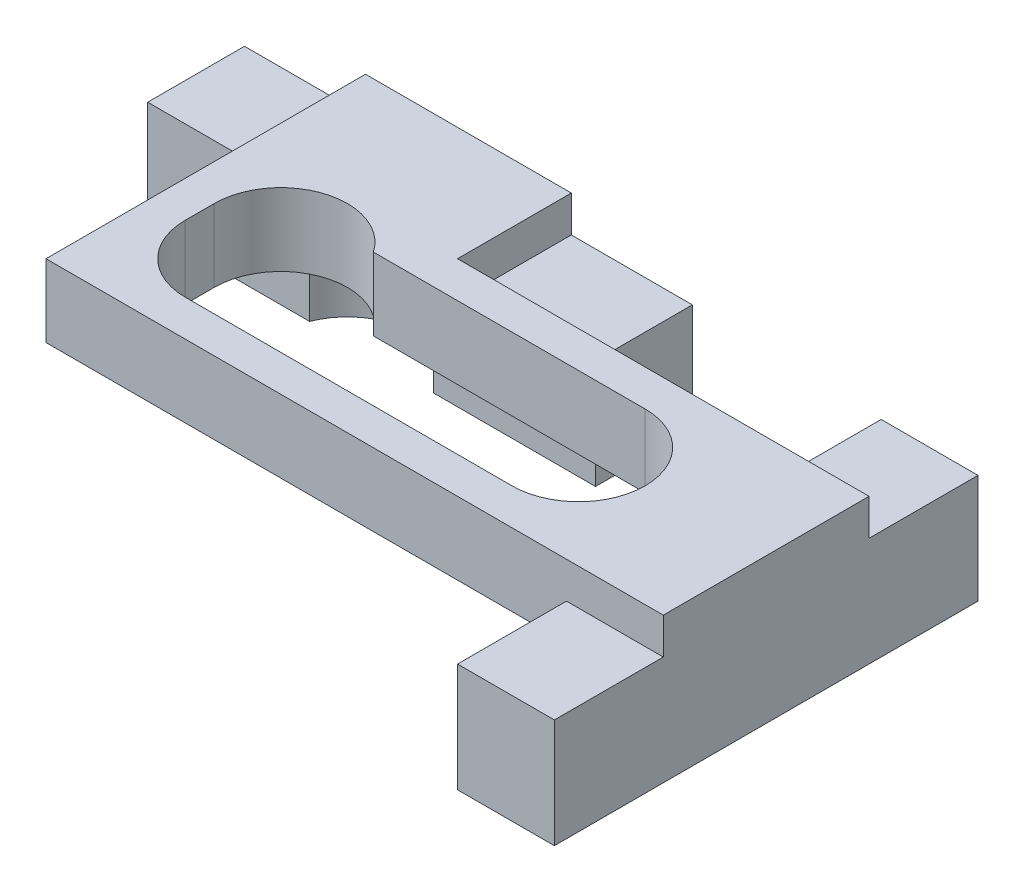
ISO-10303-21;
HEADER;
FILE_DESCRIPTION(('STEP AP214'),'2;1');
FILE_NAME('part.step','',(''),(''),'','','');
FILE_SCHEMA(('AUTOMOTIVE_DESIGN { 1 0 10303 214 1 1 1 1 }'));
ENDSEC;
DATA;
#1=APPLICATION_CONTEXT('core data for automotive mechanical design processes');
#2=APPLICATION_PROTOCOL_DEFINITION('international standard','automotive_design',2000,#1);
#3=PRODUCT_CONTEXT('',#1,'mechanical');
#4=PRODUCT('Part','Part','',(#3));
#5=PRODUCT_RELATED_PRODUCT_CATEGORY('part','',(#4));
#6=PRODUCT_DEFINITION_FORMATION('','',#4);
#7=PRODUCT_DEFINITION_CONTEXT('part definition',#1,'design');
#8=PRODUCT_DEFINITION('design','',#6,#7);
#9=PRODUCT_DEFINITION_SHAPE('','',#8);
#10=(LENGTH_UNIT() NAMED_UNIT(*) SI_UNIT(.MILLI.,.METRE.));
#11=(NAMED_UNIT(*) PLANE_ANGLE_UNIT() SI_UNIT($,.RADIAN.));
#12=(NAMED_UNIT(*) SI_UNIT($,.STERADIAN.) SOLID_ANGLE_UNIT());
#13=UNCERTAINTY_MEASURE_WITH_UNIT(LENGTH_MEASURE(1.E-05),#10,'distance_accuracy_value','');
#14=(GEOMETRIC_REPRESENTATION_CONTEXT(3) GLOBAL_UNCERTAINTY_ASSIGNED_CONTEXT((#13)) GLOBAL_UNIT_ASSIGNED_CONTEXT((#10,
#11,#12)) REPRESENTATION_CONTEXT('',''));
#15=CARTESIAN_POINT('',(0.,0.,0.));
#16=DIRECTION('',(0.,0.,1.));
#17=DIRECTION('',(1.,0.,0.));
#18=AXIS2_PLACEMENT_3D('',#15,#16,#17);
#19=CARTESIAN_POINT('',(0.,0.,4.));
#20=DIRECTION('',(0.,0.,-1.));
#21=DIRECTION('',(-1.,0.,0.));
#22=AXIS2_PLACEMENT_3D('',#19,#20,#21);
#23=PLANE('',#22);
#24=DIRECTION('',(1.,0.,0.));
#25=VECTOR('',#24,1.);
#26=CARTESIAN_POINT('',(-4.25,3.,4.));
#27=LINE('',#26,#25);
#28=CARTESIAN_POINT('',(2.5617376914899,3.,4.));
#29=VERTEX_POINT('',#28);
#30=CARTESIAN_POINT('',(4.25,3.,4.));
#31=VERTEX_POINT('',#30);
#32=EDGE_CURVE('E252',#29,#31,#27,.T.);
#33=ORIENTED_EDGE('',*,*,#32,.F.);
#34=DIRECTION('',(0.,-1.,0.));
#35=VECTOR('',#34,1.);
#36=CARTESIAN_POINT('',(2.5617376914899,3.,4.));
#37=LINE('',#36,#35);
#38=CARTESIAN_POINT('',(2.5617376914899,0.,4.));
#39=VERTEX_POINT('',#38);
#40=EDGE_CURVE('E479',#29,#39,#37,.T.);
#41=ORIENTED_EDGE('',*,*,#40,.T.);
#42=DIRECTION('',(1.,0.,0.));
#43=VECTOR('',#42,1.);
#44=CARTESIAN_POINT('',(9.25,0.,4.));
#45=LINE('',#44,#43);
#46=CARTESIAN_POINT('',(9.25,0.,4.));
#47=VERTEX_POINT('',#46);
#48=EDGE_CURVE('E272',#39,#47,#45,.T.);
#49=ORIENTED_EDGE('',*,*,#48,.T.);
#50=DIRECTION('',(0.,1.,0.));
#51=VECTOR('',#50,1.);
#52=CARTESIAN_POINT('',(9.25,0.,4.));
#53=LINE('',#52,#51);
#54=CARTESIAN_POINT('',(9.25,4.5,4.));
#55=VERTEX_POINT('',#54);
#56=EDGE_CURVE('E277',#47,#55,#53,.T.);
#57=ORIENTED_EDGE('',*,*,#56,.T.);
#58=DIRECTION('',(1.,0.,0.));
#59=VECTOR('',#58,1.);
#60=CARTESIAN_POINT('',(4.25,4.5,4.));
#61=LINE('',#60,#59);
#62=CARTESIAN_POINT('',(4.25,4.5,4.));
#63=VERTEX_POINT('',#62);
#64=EDGE_CURVE('E484',#63,#55,#61,.T.);
#65=ORIENTED_EDGE('',*,*,#64,.F.);
#66=DIRECTION('',(0.,-1.,0.));
#67=VECTOR('',#66,1.);
#68=CARTESIAN_POINT('',(4.25,4.5,4.));
#69=LINE('',#68,#67);
#70=EDGE_CURVE('E493',#63,#31,#69,.T.);
#71=ORIENTED_EDGE('',*,*,#70,.T.);
#72=EDGE_LOOP('',(#33,#41,#49,#57,#65,#71));
#73=FACE_BOUND('',#72,.T.);
#74=ADVANCED_FACE('F32',(#73),#23,.F.);
#75=CARTESIAN_POINT('',(17.25,0.,0.));
#76=DIRECTION('',(1.,0.,0.));
#77=DIRECTION('',(0.,0.,-1.));
#78=AXIS2_PLACEMENT_3D('',#75,#76,#77);
#79=PLANE('',#78);
#80=DIRECTION('',(0.,0.,-1.));
#81=VECTOR('',#80,1.);
#82=CARTESIAN_POINT('',(17.25,3.,13.2));
#83=LINE('',#82,#81);
#84=CARTESIAN_POINT('',(17.25,3.,13.2));
#85=VERTEX_POINT('',#84);
#86=CARTESIAN_POINT('',(17.25,3.,11.5117376914899));
#87=VERTEX_POINT('',#86);
#88=EDGE_CURVE('E229',#85,#87,#83,.T.);
#89=ORIENTED_EDGE('',*,*,#88,.T.);
#90=DIRECTION('',(0.,-1.,0.));
#91=VECTOR('',#90,1.);
#92=CARTESIAN_POINT('',(17.25,3.,11.5117376914899));
#93=LINE('',#92,#91);
#94=CARTESIAN_POINT('',(17.25,0.,11.5117376914899));
#95=VERTEX_POINT('',#94);
#96=EDGE_CURVE('E214',#87,#95,#93,.T.);
#97=ORIENTED_EDGE('',*,*,#96,.T.);
#98=DIRECTION('',(0.,0.,-1.));
#99=VECTOR('',#98,1.);
#100=CARTESIAN_POINT('',(17.25,0.,17.7));
#101=LINE('',#100,#99);
#102=CARTESIAN_POINT('',(17.25,0.,17.7));
#103=VERTEX_POINT('',#102);
#104=EDGE_CURVE('E349',#103,#95,#101,.T.);
#105=ORIENTED_EDGE('',*,*,#104,.F.);
#106=DIRECTION('',(0.,-1.,0.));
#107=VECTOR('',#106,1.);
#108=CARTESIAN_POINT('',(17.25,0.,17.7));
#109=LINE('',#108,#107);
#110=CARTESIAN_POINT('',(17.25,4.5,17.7));
#111=VERTEX_POINT('',#110);
#112=EDGE_CURVE('E370',#111,#103,#109,.T.);
#113=ORIENTED_EDGE('',*,*,#112,.F.);
#114=DIRECTION('',(0.,0.,1.));
#115=VECTOR('',#114,1.);
#116=CARTESIAN_POINT('',(17.25,4.5,17.7));
#117=LINE('',#116,#115);
#118=CARTESIAN_POINT('',(17.25,4.5,13.2));
#119=VERTEX_POINT('',#118);
#120=EDGE_CURVE('E368',#119,#111,#117,.T.);
#121=ORIENTED_EDGE('',*,*,#120,.F.);
#122=DIRECTION('',(0.,-1.,0.));
#123=VECTOR('',#122,1.);
#124=CARTESIAN_POINT('',(17.25,6.,13.2));
#125=LINE('',#124,#123);
#126=EDGE_CURVE('E237',#119,#85,#125,.T.);
#127=ORIENTED_EDGE('',*,*,#126,.T.);
#128=EDGE_LOOP('',(#89,#97,#105,#113,#121,#127));
#129=FACE_BOUND('',#128,.T.);
#130=ADVANCED_FACE('F235',(#129),#79,.F.);
#131=CARTESIAN_POINT('',(4.25,3.,4.));
#132=DIRECTION('',(-1.,0.,0.));
#133=DIRECTION('',(0.,0.,1.));
#134=AXIS2_PLACEMENT_3D('',#131,#132,#133);
#135=PLANE('',#134);
#136=ORIENTED_EDGE('',*,*,#70,.F.);
#137=DIRECTION('',(0.,0.,1.));
#138=VECTOR('',#137,1.);
#139=CARTESIAN_POINT('',(4.25,4.5,0.));
#140=LINE('',#139,#138);
#141=CARTESIAN_POINT('',(4.25,4.5,0.));
#142=VERTEX_POINT('',#141);
#143=EDGE_CURVE('E481',#142,#63,#140,.T.);
#144=ORIENTED_EDGE('',*,*,#143,.F.);
#145=DIRECTION('',(0.,1.,0.));
#146=VECTOR('',#145,1.);
#147=CARTESIAN_POINT('',(4.25,3.,0.));
#148=LINE('',#147,#146);
#149=CARTESIAN_POINT('',(4.25,6.,0.));
#150=VERTEX_POINT('',#149);
#151=EDGE_CURVE('E269',#142,#150,#148,.T.);
#152=ORIENTED_EDGE('',*,*,#151,.T.);
#153=DIRECTION('',(0.,0.,-1.));
#154=VECTOR('',#153,1.);
#155=CARTESIAN_POINT('',(4.25,6.,4.));
#156=LINE('',#155,#154);
#157=CARTESIAN_POINT('',(4.25,6.,4.7));
#158=VERTEX_POINT('',#157);
#159=EDGE_CURVE('E298',#158,#150,#156,.T.);
#160=ORIENTED_EDGE('',*,*,#159,.F.);
#161=DIRECTION('',(0.,1.,0.));
#162=VECTOR('',#161,1.);
#163=CARTESIAN_POINT('',(4.25,6.,4.7));
#164=LINE('',#163,#162);
#165=CARTESIAN_POINT('',(4.25,3.,4.7));
#166=VERTEX_POINT('',#165);
#167=EDGE_CURVE('E245',#166,#158,#164,.T.);
#168=ORIENTED_EDGE('',*,*,#167,.F.);
#169=DIRECTION('',(0.,0.,-1.));
#170=VECTOR('',#169,1.);
#171=CARTESIAN_POINT('',(4.25,3.,13.2));
#172=LINE('',#171,#170);
#173=EDGE_CURVE('E262',#166,#31,#172,.T.);
#174=ORIENTED_EDGE('',*,*,#173,.T.);
#175=EDGE_LOOP('',(#136,#144,#152,#160,#168,#174));
#176=FACE_BOUND('',#175,.T.);
#177=ADVANCED_FACE('F34',(#176),#135,.F.);
#178=CARTESIAN_POINT('',(-4.25,3.,4.));
#179=DIRECTION('',(1.,0.,0.));
#180=DIRECTION('',(0.,0.,-1.));
#181=AXIS2_PLACEMENT_3D('',#178,#179,#180);
#182=PLANE('',#181);
#183=DIRECTION('',(0.,-1.,0.));
#184=VECTOR('',#183,1.);
#185=CARTESIAN_POINT('',(-4.25,4.49999999999999,4.));
#186=LINE('',#185,#184);
#187=CARTESIAN_POINT('',(-4.25,4.49999999999999,4.));
#188=VERTEX_POINT('',#187);
#189=CARTESIAN_POINT('',(-4.25,3.,4.));
#190=VERTEX_POINT('',#189);
#191=EDGE_CURVE('E421',#188,#190,#186,.T.);
#192=ORIENTED_EDGE('',*,*,#191,.T.);
#193=DIRECTION('',(0.,0.,-1.));
#194=VECTOR('',#193,1.);
#195=CARTESIAN_POINT('',(-4.25,3.,13.2));
#196=LINE('',#195,#194);
#197=CARTESIAN_POINT('',(-4.25,3.,13.2));
#198=VERTEX_POINT('',#197);
#199=EDGE_CURVE('E266',#198,#190,#196,.T.);
#200=ORIENTED_EDGE('',*,*,#199,.F.);
#201=DIRECTION('',(0.,-1.,0.));
#202=VECTOR('',#201,1.);
#203=CARTESIAN_POINT('',(-4.25,6.,13.2));
#204=LINE('',#203,#202);
#205=CARTESIAN_POINT('',(-4.25,6.,13.2));
#206=VERTEX_POINT('',#205);
#207=EDGE_CURVE('E253',#206,#198,#204,.T.);
#208=ORIENTED_EDGE('',*,*,#207,.F.);
#209=DIRECTION('',(0.,0.,-1.));
#210=VECTOR('',#209,1.);
#211=CARTESIAN_POINT('',(-4.25,6.,4.));
#212=LINE('',#211,#210);
#213=CARTESIAN_POINT('',(-4.25,6.,0.));
#214=VERTEX_POINT('',#213);
#215=EDGE_CURVE('E295',#206,#214,#212,.T.);
#216=ORIENTED_EDGE('',*,*,#215,.T.);
#217=DIRECTION('',(0.,-1.,0.));
#218=VECTOR('',#217,1.);
#219=CARTESIAN_POINT('',(-4.25,3.,0.));
#220=LINE('',#219,#218);
#221=CARTESIAN_POINT('',(-4.25,4.49999999999999,0.));
#222=VERTEX_POINT('',#221);
#223=EDGE_CURVE('E283',#214,#222,#220,.T.);
#224=ORIENTED_EDGE('',*,*,#223,.T.);
#225=DIRECTION('',(0.,0.,-1.));
#226=VECTOR('',#225,1.);
#227=CARTESIAN_POINT('',(-4.25,4.49999999999999,0.));
#228=LINE('',#227,#226);
#229=EDGE_CURVE('E502',#188,#222,#228,.T.);
#230=ORIENTED_EDGE('',*,*,#229,.F.);
#231=EDGE_LOOP('',(#192,#200,#208,#216,#224,#230));
#232=FACE_BOUND('',#231,.T.);
#233=ADVANCED_FACE('F418',(#232),#182,.F.);
#234=CARTESIAN_POINT('',(-9.25,0.,4.));
#235=VERTEX_POINT('',#234);
#236=CARTESIAN_POINT('',(-2.5617376914899,0.,4.));
#237=VERTEX_POINT('',#236);
#238=EDGE_CURVE('E274',#235,#237,#45,.T.);
#239=ORIENTED_EDGE('',*,*,#238,.T.);
#240=DIRECTION('',(0.,-1.,0.));
#241=VECTOR('',#240,1.);
#242=CARTESIAN_POINT('',(-2.5617376914899,3.,4.));
#243=LINE('',#242,#241);
#244=CARTESIAN_POINT('',(-2.5617376914899,3.,4.));
#245=VERTEX_POINT('',#244);
#246=EDGE_CURVE('E47',#237,#245,#243,.F.);
#247=ORIENTED_EDGE('',*,*,#246,.T.);
#248=EDGE_CURVE('E257',#190,#245,#27,.T.);
#249=ORIENTED_EDGE('',*,*,#248,.F.);
#250=ORIENTED_EDGE('',*,*,#191,.F.);
#251=DIRECTION('',(1.,0.,0.));
#252=VECTOR('',#251,1.);
#253=CARTESIAN_POINT('',(-9.25,4.49999999999999,4.));
#254=LINE('',#253,#252);
#255=CARTESIAN_POINT('',(-9.25,4.49999999999999,4.));
#256=VERTEX_POINT('',#255);
#257=EDGE_CURVE('E499',#256,#188,#254,.T.);
#258=ORIENTED_EDGE('',*,*,#257,.F.);
#259=DIRECTION('',(0.,-1.,0.));
#260=VECTOR('',#259,1.);
#261=CARTESIAN_POINT('',(-9.25,0.,4.));
#262=LINE('',#261,#260);
#263=EDGE_CURVE('E270',#256,#235,#262,.T.);
#264=ORIENTED_EDGE('',*,*,#263,.T.);
#265=EDGE_LOOP('',(#239,#247,#249,#250,#258,#264));
#266=FACE_BOUND('',#265,.T.);
#267=ADVANCED_FACE('F448',(#266),#23,.F.);
#268=CARTESIAN_POINT('',(-4.25,6.,4.));
#269=DIRECTION('',(0.,-1.,0.));
#270=DIRECTION('',(0.,0.,-1.));
#271=AXIS2_PLACEMENT_3D('',#268,#269,#270);
#272=PLANE('',#271);
#273=DIRECTION('',(1.,0.,0.));
#274=VECTOR('',#273,1.);
#275=CARTESIAN_POINT('',(13.5,6.,11.7));
#276=LINE('',#275,#274);
#277=CARTESIAN_POINT('',(0.,6.,11.7));
#278=VERTEX_POINT('',#277);
#279=CARTESIAN_POINT('',(13.5,6.,11.7));
#280=VERTEX_POINT('',#279);
#281=EDGE_CURVE('E511',#278,#280,#276,.T.);
#282=ORIENTED_EDGE('',*,*,#281,.F.);
#283=CARTESIAN_POINT('',(0.,6.,8.95));
#284=DIRECTION('',(0.,1.,0.));
#285=DIRECTION('',(0.,0.,-1.));
#286=AXIS2_PLACEMENT_3D('',#283,#284,#285);
#287=CIRCLE('',#286,2.75);
#288=CARTESIAN_POINT('',(-2.75,6.,8.95));
#289=VERTEX_POINT('',#288);
#290=EDGE_CURVE('E509',#289,#278,#287,.T.);
#291=ORIENTED_EDGE('',*,*,#290,.F.);
#292=DIRECTION('',(0.,0.,1.));
#293=VECTOR('',#292,1.);
#294=CARTESIAN_POINT('',(-2.75,6.,7.75));
#295=LINE('',#294,#293);
#296=CARTESIAN_POINT('',(-2.75,6.,7.75));
#297=VERTEX_POINT('',#296);
#298=EDGE_CURVE('E326',#297,#289,#295,.T.);
#299=ORIENTED_EDGE('',*,*,#298,.F.);
#300=CARTESIAN_POINT('',(0.,6.,7.75));
#301=DIRECTION('',(0.,1.,0.));
#302=DIRECTION('',(0.,0.,1.));
#303=AXIS2_PLACEMENT_3D('',#300,#301,#302);
#304=CIRCLE('',#303,2.75);
#305=CARTESIAN_POINT('',(2.27156333832011,6.,6.2));
#306=VERTEX_POINT('',#305);
#307=EDGE_CURVE('E519',#306,#297,#304,.T.);
#308=ORIENTED_EDGE('',*,*,#307,.F.);
#309=DIRECTION('',(-1.,0.,0.));
#310=VECTOR('',#309,1.);
#311=CARTESIAN_POINT('',(13.5,6.,6.2));
#312=LINE('',#311,#310);
#313=CARTESIAN_POINT('',(13.5,6.,6.2));
#314=VERTEX_POINT('',#313);
#315=EDGE_CURVE('E517',#314,#306,#312,.T.);
#316=ORIENTED_EDGE('',*,*,#315,.F.);
#317=CARTESIAN_POINT('',(13.5,6.,8.95));
#318=DIRECTION('',(0.,1.,0.));
#319=DIRECTION('',(0.,0.,1.));
#320=AXIS2_PLACEMENT_3D('',#317,#318,#319);
#321=CIRCLE('',#320,2.75);
#322=EDGE_CURVE('E514',#280,#314,#321,.T.);
#323=ORIENTED_EDGE('',*,*,#322,.F.);
#324=EDGE_LOOP('',(#282,#291,#299,#308,#316,#323));
#325=FACE_BOUND('',#324,.T.);
#326=DIRECTION('',(-1.,0.,0.));
#327=VECTOR('',#326,1.);
#328=CARTESIAN_POINT('',(-4.25,6.,0.));
#329=LINE('',#328,#327);
#330=EDGE_CURVE('E281',#150,#214,#329,.T.);
#331=ORIENTED_EDGE('',*,*,#330,.T.);
#332=ORIENTED_EDGE('',*,*,#215,.F.);
#333=DIRECTION('',(-1.,0.,0.));
#334=VECTOR('',#333,1.);
#335=CARTESIAN_POINT('',(-4.25,6.,13.2));
#336=LINE('',#335,#334);
#337=CARTESIAN_POINT('',(21.25,6.,13.2));
#338=VERTEX_POINT('',#337);
#339=EDGE_CURVE('E259',#338,#206,#336,.T.);
#340=ORIENTED_EDGE('',*,*,#339,.F.);
#341=DIRECTION('',(0.,0.,1.));
#342=VECTOR('',#341,1.);
#343=CARTESIAN_POINT('',(21.25,6.,13.2));
#344=LINE('',#343,#342);
#345=CARTESIAN_POINT('',(21.25,6.,4.7));
#346=VERTEX_POINT('',#345);
#347=EDGE_CURVE('E354',#346,#338,#344,.T.);
#348=ORIENTED_EDGE('',*,*,#347,.F.);
#349=DIRECTION('',(-1.,0.,0.));
#350=VECTOR('',#349,1.);
#351=CARTESIAN_POINT('',(17.25,6.,4.7));
#352=LINE('',#351,#350);
#353=EDGE_CURVE('E240',#346,#158,#352,.T.);
#354=ORIENTED_EDGE('',*,*,#353,.T.);
#355=ORIENTED_EDGE('',*,*,#159,.T.);
#356=EDGE_LOOP('',(#331,#332,#340,#348,#354,#355));
#357=FACE_BOUND('',#356,.T.);
#358=ADVANCED_FACE('F410',(#325,#357),#272,.F.);
#359=CARTESIAN_POINT('',(-9.25,0.,4.));
#360=DIRECTION('',(1.,0.,0.));
#361=DIRECTION('',(0.,0.,-1.));
#362=AXIS2_PLACEMENT_3D('',#359,#360,#361);
#363=PLANE('',#362);
#364=DIRECTION('',(0.,-1.,0.));
#365=VECTOR('',#364,1.);
#366=CARTESIAN_POINT('',(-9.25,0.,0.));
#367=LINE('',#366,#365);
#368=CARTESIAN_POINT('',(-9.25,4.49999999999999,0.));
#369=VERTEX_POINT('',#368);
#370=CARTESIAN_POINT('',(-9.25,0.,0.));
#371=VERTEX_POINT('',#370);
#372=EDGE_CURVE('E285',#369,#371,#367,.T.);
#373=ORIENTED_EDGE('',*,*,#372,.T.);
#374=DIRECTION('',(0.,0.,-1.));
#375=VECTOR('',#374,1.);
#376=CARTESIAN_POINT('',(-9.25,0.,4.));
#377=LINE('',#376,#375);
#378=EDGE_CURVE('E292',#235,#371,#377,.T.);
#379=ORIENTED_EDGE('',*,*,#378,.F.);
#380=ORIENTED_EDGE('',*,*,#263,.F.);
#381=DIRECTION('',(0.,0.,1.));
#382=VECTOR('',#381,1.);
#383=CARTESIAN_POINT('',(-9.25,4.49999999999999,0.));
#384=LINE('',#383,#382);
#385=EDGE_CURVE('E496',#369,#256,#384,.T.);
#386=ORIENTED_EDGE('',*,*,#385,.F.);
#387=EDGE_LOOP('',(#373,#379,#380,#386));
#388=FACE_BOUND('',#387,.T.);
#389=ADVANCED_FACE('F461',(#388),#363,.F.);
#390=CARTESIAN_POINT('',(9.25,0.,4.));
#391=DIRECTION('',(0.,1.,0.));
#392=DIRECTION('',(-1.,0.,0.));
#393=AXIS2_PLACEMENT_3D('',#390,#391,#392);
#394=PLANE('',#393);
#395=ORIENTED_EDGE('',*,*,#48,.F.);
#396=CARTESIAN_POINT('',(0.,0.,5.));
#397=DIRECTION('',(0.,-1.,0.));
#398=DIRECTION('',(1.,0.,0.));
#399=AXIS2_PLACEMENT_3D('',#396,#397,#398);
#400=CIRCLE('',#399,2.75);
#401=EDGE_CURVE('E233',#237,#39,#400,.T.);
#402=ORIENTED_EDGE('',*,*,#401,.F.);
#403=ORIENTED_EDGE('',*,*,#238,.F.);
#404=ORIENTED_EDGE('',*,*,#378,.T.);
#405=DIRECTION('',(1.,0.,0.));
#406=VECTOR('',#405,1.);
#407=CARTESIAN_POINT('',(9.25,0.,0.));
#408=LINE('',#407,#406);
#409=CARTESIAN_POINT('',(9.25,0.,0.));
#410=VERTEX_POINT('',#409);
#411=EDGE_CURVE('E287',#371,#410,#408,.T.);
#412=ORIENTED_EDGE('',*,*,#411,.T.);
#413=DIRECTION('',(0.,0.,-1.));
#414=VECTOR('',#413,1.);
#415=CARTESIAN_POINT('',(9.25,0.,4.));
#416=LINE('',#415,#414);
#417=EDGE_CURVE('E279',#47,#410,#416,.T.);
#418=ORIENTED_EDGE('',*,*,#417,.F.);
#419=EDGE_LOOP('',(#395,#402,#403,#404,#412,#418));
#420=FACE_BOUND('',#419,.T.);
#421=ADVANCED_FACE('F469',(#420),#394,.F.);
#422=CARTESIAN_POINT('',(9.25,0.,4.));
#423=DIRECTION('',(-1.,0.,0.));
#424=DIRECTION('',(0.,0.,1.));
#425=AXIS2_PLACEMENT_3D('',#422,#423,#424);
#426=PLANE('',#425);
#427=DIRECTION('',(0.,1.,0.));
#428=VECTOR('',#427,1.);
#429=CARTESIAN_POINT('',(9.25,0.,0.));
#430=LINE('',#429,#428);
#431=CARTESIAN_POINT('',(9.25,4.5,0.));
#432=VERTEX_POINT('',#431);
#433=EDGE_CURVE('E273',#410,#432,#430,.T.);
#434=ORIENTED_EDGE('',*,*,#433,.T.);
#435=DIRECTION('',(0.,0.,-1.));
#436=VECTOR('',#435,1.);
#437=CARTESIAN_POINT('',(9.25,4.5,0.));
#438=LINE('',#437,#436);
#439=EDGE_CURVE('E487',#55,#432,#438,.T.);
#440=ORIENTED_EDGE('',*,*,#439,.F.);
#441=ORIENTED_EDGE('',*,*,#56,.F.);
#442=ORIENTED_EDGE('',*,*,#417,.T.);
#443=EDGE_LOOP('',(#434,#440,#441,#442));
#444=FACE_BOUND('',#443,.T.);
#445=ADVANCED_FACE('F569',(#444),#426,.F.);
#446=CARTESIAN_POINT('',(0.,0.,0.));
#447=DIRECTION('',(0.,0.,-1.));
#448=DIRECTION('',(-1.,0.,0.));
#449=AXIS2_PLACEMENT_3D('',#446,#447,#448);
#450=PLANE('',#449);
#451=ORIENTED_EDGE('',*,*,#151,.F.);
#452=DIRECTION('',(-1.,0.,0.));
#453=VECTOR('',#452,1.);
#454=CARTESIAN_POINT('',(4.25,4.5,0.));
#455=LINE('',#454,#453);
#456=EDGE_CURVE('E490',#432,#142,#455,.T.);
#457=ORIENTED_EDGE('',*,*,#456,.F.);
#458=ORIENTED_EDGE('',*,*,#433,.F.);
#459=ORIENTED_EDGE('',*,*,#411,.F.);
#460=ORIENTED_EDGE('',*,*,#372,.F.);
#461=DIRECTION('',(-1.,0.,0.));
#462=VECTOR('',#461,1.);
#463=CARTESIAN_POINT('',(-9.25,4.49999999999999,0.));
#464=LINE('',#463,#462);
#465=EDGE_CURVE('E505',#222,#369,#464,.T.);
#466=ORIENTED_EDGE('',*,*,#465,.F.);
#467=ORIENTED_EDGE('',*,*,#223,.F.);
#468=ORIENTED_EDGE('',*,*,#330,.F.);
#469=EDGE_LOOP('',(#451,#457,#458,#459,#460,#466,#467,#468));
#470=FACE_BOUND('',#469,.T.);
#471=ADVANCED_FACE('F565',(#470),#450,.T.);
#472=CARTESIAN_POINT('',(-4.25,3.,13.2));
#473=DIRECTION('',(0.,1.,0.));
#474=DIRECTION('',(0.,0.,1.));
#475=AXIS2_PLACEMENT_3D('',#472,#473,#474);
#476=PLANE('',#475);
#477=ORIENTED_EDGE('',*,*,#248,.T.);
#478=CARTESIAN_POINT('',(0.,3.,5.));
#479=DIRECTION('',(0.,-1.,0.));
#480=DIRECTION('',(1.,0.,0.));
#481=AXIS2_PLACEMENT_3D('',#478,#479,#480);
#482=CIRCLE('',#481,2.75);
#483=EDGE_CURVE('E473',#245,#29,#482,.T.);
#484=ORIENTED_EDGE('',*,*,#483,.T.);
#485=ORIENTED_EDGE('',*,*,#32,.T.);
#486=ORIENTED_EDGE('',*,*,#173,.F.);
#487=DIRECTION('',(-1.,0.,0.));
#488=VECTOR('',#487,1.);
#489=CARTESIAN_POINT('',(17.25,3.,4.7));
#490=LINE('',#489,#488);
#491=CARTESIAN_POINT('',(17.25,3.,4.7));
#492=VERTEX_POINT('',#491);
#493=EDGE_CURVE('E250',#492,#166,#490,.T.);
#494=ORIENTED_EDGE('',*,*,#493,.F.);
#495=CARTESIAN_POINT('',(17.25,3.,6.3882623085101));
#496=VERTEX_POINT('',#495);
#497=EDGE_CURVE('E232',#496,#492,#83,.T.);
#498=ORIENTED_EDGE('',*,*,#497,.F.);
#499=CARTESIAN_POINT('',(16.25,3.,8.95));
#500=DIRECTION('',(0.,-1.,0.));
#501=DIRECTION('',(1.,0.,0.));
#502=AXIS2_PLACEMENT_3D('',#499,#500,#501);
#503=CIRCLE('',#502,2.75);
#504=EDGE_CURVE('E217',#496,#87,#503,.T.);
#505=ORIENTED_EDGE('',*,*,#504,.T.);
#506=ORIENTED_EDGE('',*,*,#88,.F.);
#507=DIRECTION('',(1.,0.,0.));
#508=VECTOR('',#507,1.);
#509=CARTESIAN_POINT('',(-4.25,3.,13.2));
#510=LINE('',#509,#508);
#511=EDGE_CURVE('E256',#198,#85,#510,.T.);
#512=ORIENTED_EDGE('',*,*,#511,.F.);
#513=ORIENTED_EDGE('',*,*,#199,.T.);
#514=EDGE_LOOP('',(#477,#484,#485,#486,#494,#498,#505,#506,#512,#513));
#515=FACE_BOUND('',#514,.T.);
#516=DIRECTION('',(-1.,0.,0.));
#517=VECTOR('',#516,1.);
#518=CARTESIAN_POINT('',(-4.25,3.,6.2));
#519=LINE('',#518,#517);
#520=CARTESIAN_POINT('',(13.5,3.,6.2));
#521=VERTEX_POINT('',#520);
#522=CARTESIAN_POINT('',(2.27156333832011,3.,6.2));
#523=VERTEX_POINT('',#522);
#524=EDGE_CURVE('E306',#521,#523,#519,.T.);
#525=ORIENTED_EDGE('',*,*,#524,.T.);
#526=CARTESIAN_POINT('',(0.,3.,7.75));
#527=DIRECTION('',(0.,1.,0.));
#528=DIRECTION('',(0.,0.,1.));
#529=AXIS2_PLACEMENT_3D('',#526,#527,#528);
#530=CIRCLE('',#529,2.75);
#531=CARTESIAN_POINT('',(-2.75,3.,7.75));
#532=VERTEX_POINT('',#531);
#533=EDGE_CURVE('E308',#523,#532,#530,.T.);
#534=ORIENTED_EDGE('',*,*,#533,.T.);
#535=DIRECTION('',(0.,0.,1.));
#536=VECTOR('',#535,1.);
#537=CARTESIAN_POINT('',(-2.75,3.,13.2));
#538=LINE('',#537,#536);
#539=CARTESIAN_POINT('',(-2.75,3.,8.95));
#540=VERTEX_POINT('',#539);
#541=EDGE_CURVE('E310',#532,#540,#538,.T.);
#542=ORIENTED_EDGE('',*,*,#541,.T.);
#543=CARTESIAN_POINT('',(0.,3.,8.95));
#544=DIRECTION('',(0.,1.,0.));
#545=DIRECTION('',(0.,0.,1.));
#546=AXIS2_PLACEMENT_3D('',#543,#544,#545);
#547=CIRCLE('',#546,2.75);
#548=CARTESIAN_POINT('',(0.,3.,11.7));
#549=VERTEX_POINT('',#548);
#550=EDGE_CURVE('E40',#540,#549,#547,.T.);
#551=ORIENTED_EDGE('',*,*,#550,.T.);
#552=DIRECTION('',(1.,0.,0.));
#553=VECTOR('',#552,1.);
#554=CARTESIAN_POINT('',(-4.25,3.,11.7));
#555=LINE('',#554,#553);
#556=CARTESIAN_POINT('',(13.5,3.,11.7));
#557=VERTEX_POINT('',#556);
#558=EDGE_CURVE('E301',#549,#557,#555,.T.);
#559=ORIENTED_EDGE('',*,*,#558,.T.);
#560=CARTESIAN_POINT('',(13.5,3.,8.95));
#561=DIRECTION('',(0.,1.,0.));
#562=DIRECTION('',(0.,0.,1.));
#563=AXIS2_PLACEMENT_3D('',#560,#561,#562);
#564=CIRCLE('',#563,2.75);
#565=EDGE_CURVE('E304',#557,#521,#564,.T.);
#566=ORIENTED_EDGE('',*,*,#565,.T.);
#567=EDGE_LOOP('',(#525,#534,#542,#551,#559,#566));
#568=FACE_BOUND('',#567,.T.);
#569=ADVANCED_FACE('F227',(#515,#568),#476,.F.);
#570=CARTESIAN_POINT('',(0.,0.,13.2));
#571=DIRECTION('',(0.,0.,1.));
#572=DIRECTION('',(1.,0.,0.));
#573=AXIS2_PLACEMENT_3D('',#570,#571,#572);
#574=PLANE('',#573);
#575=ORIENTED_EDGE('',*,*,#207,.T.);
#576=ORIENTED_EDGE('',*,*,#511,.T.);
#577=ORIENTED_EDGE('',*,*,#126,.F.);
#578=DIRECTION('',(-1.,0.,0.));
#579=VECTOR('',#578,1.);
#580=CARTESIAN_POINT('',(21.25,4.5,13.2));
#581=LINE('',#580,#579);
#582=CARTESIAN_POINT('',(21.25,4.5,13.2));
#583=VERTEX_POINT('',#582);
#584=EDGE_CURVE('E382',#583,#119,#581,.T.);
#585=ORIENTED_EDGE('',*,*,#584,.F.);
#586=DIRECTION('',(0.,-1.,0.));
#587=VECTOR('',#586,1.);
#588=CARTESIAN_POINT('',(21.25,4.5,13.2));
#589=LINE('',#588,#587);
#590=EDGE_CURVE('E357',#338,#583,#589,.T.);
#591=ORIENTED_EDGE('',*,*,#590,.F.);
#592=ORIENTED_EDGE('',*,*,#339,.T.);
#593=EDGE_LOOP('',(#575,#576,#577,#585,#591,#592));
#594=FACE_BOUND('',#593,.T.);
#595=ADVANCED_FACE('F414',(#594),#574,.T.);
#596=CARTESIAN_POINT('',(17.25,6.,4.7));
#597=DIRECTION('',(0.,0.,1.));
#598=DIRECTION('',(1.,0.,0.));
#599=AXIS2_PLACEMENT_3D('',#596,#597,#598);
#600=PLANE('',#599);
#601=ORIENTED_EDGE('',*,*,#167,.T.);
#602=ORIENTED_EDGE('',*,*,#353,.F.);
#603=DIRECTION('',(0.,1.,0.));
#604=VECTOR('',#603,1.);
#605=CARTESIAN_POINT('',(21.25,4.5,4.7));
#606=LINE('',#605,#604);
#607=CARTESIAN_POINT('',(21.25,4.5,4.7));
#608=VERTEX_POINT('',#607);
#609=EDGE_CURVE('E351',#608,#346,#606,.T.);
#610=ORIENTED_EDGE('',*,*,#609,.F.);
#611=DIRECTION('',(-1.,0.,0.));
#612=VECTOR('',#611,1.);
#613=CARTESIAN_POINT('',(21.25,4.5,4.7));
#614=LINE('',#613,#612);
#615=CARTESIAN_POINT('',(17.25,4.5,4.7));
#616=VERTEX_POINT('',#615);
#617=EDGE_CURVE('E385',#608,#616,#614,.T.);
#618=ORIENTED_EDGE('',*,*,#617,.T.);
#619=DIRECTION('',(0.,1.,0.));
#620=VECTOR('',#619,1.);
#621=CARTESIAN_POINT('',(17.25,6.,4.7));
#622=LINE('',#621,#620);
#623=EDGE_CURVE('E238',#492,#616,#622,.T.);
#624=ORIENTED_EDGE('',*,*,#623,.F.);
#625=ORIENTED_EDGE('',*,*,#493,.T.);
#626=EDGE_LOOP('',(#601,#602,#610,#618,#624,#625));
#627=FACE_BOUND('',#626,.T.);
#628=ADVANCED_FACE('F402',(#627),#600,.F.);
#629=CARTESIAN_POINT('',(17.25,0.,6.3882623085101));
#630=VERTEX_POINT('',#629);
#631=CARTESIAN_POINT('',(17.25,0.,0.199999999999999));
#632=VERTEX_POINT('',#631);
#633=EDGE_CURVE('E372',#630,#632,#101,.T.);
#634=ORIENTED_EDGE('',*,*,#633,.F.);
#635=DIRECTION('',(0.,-1.,0.));
#636=VECTOR('',#635,1.);
#637=CARTESIAN_POINT('',(17.25,3.,6.3882623085101));
#638=LINE('',#637,#636);
#639=EDGE_CURVE('E55',#630,#496,#638,.F.);
#640=ORIENTED_EDGE('',*,*,#639,.T.);
#641=ORIENTED_EDGE('',*,*,#497,.T.);
#642=ORIENTED_EDGE('',*,*,#623,.T.);
#643=DIRECTION('',(0.,0.,1.));
#644=VECTOR('',#643,1.);
#645=CARTESIAN_POINT('',(17.25,4.5,0.199999999999999));
#646=LINE('',#645,#644);
#647=CARTESIAN_POINT('',(17.25,4.5,0.199999999999999));
#648=VERTEX_POINT('',#647);
#649=EDGE_CURVE('E332',#648,#616,#646,.T.);
#650=ORIENTED_EDGE('',*,*,#649,.F.);
#651=DIRECTION('',(0.,1.,0.));
#652=VECTOR('',#651,1.);
#653=CARTESIAN_POINT('',(17.25,0.,0.199999999999999));
#654=LINE('',#653,#652);
#655=EDGE_CURVE('E328',#632,#648,#654,.T.);
#656=ORIENTED_EDGE('',*,*,#655,.F.);
#657=EDGE_LOOP('',(#634,#640,#641,#642,#650,#656));
#658=FACE_BOUND('',#657,.T.);
#659=ADVANCED_FACE('F399',(#658),#79,.F.);
#660=CARTESIAN_POINT('',(21.25,0.,0.199999999999999));
#661=DIRECTION('',(0.,0.,1.));
#662=DIRECTION('',(1.,0.,0.));
#663=AXIS2_PLACEMENT_3D('',#660,#661,#662);
#664=PLANE('',#663);
#665=ORIENTED_EDGE('',*,*,#655,.T.);
#666=DIRECTION('',(-1.,0.,0.));
#667=VECTOR('',#666,1.);
#668=CARTESIAN_POINT('',(21.25,4.5,0.199999999999999));
#669=LINE('',#668,#667);
#670=CARTESIAN_POINT('',(21.25,4.5,0.199999999999999));
#671=VERTEX_POINT('',#670);
#672=EDGE_CURVE('E247',#671,#648,#669,.T.);
#673=ORIENTED_EDGE('',*,*,#672,.F.);
#674=DIRECTION('',(0.,1.,0.));
#675=VECTOR('',#674,1.);
#676=CARTESIAN_POINT('',(21.25,0.,0.199999999999999));
#677=LINE('',#676,#675);
#678=CARTESIAN_POINT('',(21.25,0.,0.199999999999999));
#679=VERTEX_POINT('',#678);
#680=EDGE_CURVE('E345',#679,#671,#677,.T.);
#681=ORIENTED_EDGE('',*,*,#680,.F.);
#682=DIRECTION('',(-1.,0.,0.));
#683=VECTOR('',#682,1.);
#684=CARTESIAN_POINT('',(21.25,0.,0.199999999999999));
#685=LINE('',#684,#683);
#686=EDGE_CURVE('E364',#679,#632,#685,.T.);
#687=ORIENTED_EDGE('',*,*,#686,.T.);
#688=EDGE_LOOP('',(#665,#673,#681,#687));
#689=FACE_BOUND('',#688,.T.);
#690=ADVANCED_FACE('F395',(#689),#664,.F.);
#691=CARTESIAN_POINT('',(21.25,4.5,0.199999999999999));
#692=DIRECTION('',(0.,-1.,0.));
#693=DIRECTION('',(0.,0.,-1.));
#694=AXIS2_PLACEMENT_3D('',#691,#692,#693);
#695=PLANE('',#694);
#696=ORIENTED_EDGE('',*,*,#649,.T.);
#697=ORIENTED_EDGE('',*,*,#617,.F.);
#698=DIRECTION('',(0.,0.,1.));
#699=VECTOR('',#698,1.);
#700=CARTESIAN_POINT('',(21.25,4.5,0.199999999999999));
#701=LINE('',#700,#699);
#702=EDGE_CURVE('E348',#671,#608,#701,.T.);
#703=ORIENTED_EDGE('',*,*,#702,.F.);
#704=ORIENTED_EDGE('',*,*,#672,.T.);
#705=EDGE_LOOP('',(#696,#697,#703,#704));
#706=FACE_BOUND('',#705,.T.);
#707=ADVANCED_FACE('F390',(#706),#695,.F.);
#708=CARTESIAN_POINT('',(21.25,4.5,17.7));
#709=DIRECTION('',(0.,-1.,0.));
#710=DIRECTION('',(0.,0.,-1.));
#711=AXIS2_PLACEMENT_3D('',#708,#709,#710);
#712=PLANE('',#711);
#713=ORIENTED_EDGE('',*,*,#120,.T.);
#714=DIRECTION('',(-1.,0.,0.));
#715=VECTOR('',#714,1.);
#716=CARTESIAN_POINT('',(21.25,4.5,17.7));
#717=LINE('',#716,#715);
#718=CARTESIAN_POINT('',(21.25,4.5,17.7));
#719=VERTEX_POINT('',#718);
#720=EDGE_CURVE('E379',#719,#111,#717,.T.);
#721=ORIENTED_EDGE('',*,*,#720,.F.);
#722=DIRECTION('',(0.,0.,1.));
#723=VECTOR('',#722,1.);
#724=CARTESIAN_POINT('',(21.25,4.5,17.7));
#725=LINE('',#724,#723);
#726=EDGE_CURVE('E359',#583,#719,#725,.T.);
#727=ORIENTED_EDGE('',*,*,#726,.F.);
#728=ORIENTED_EDGE('',*,*,#584,.T.);
#729=EDGE_LOOP('',(#713,#721,#727,#728));
#730=FACE_BOUND('',#729,.T.);
#731=ADVANCED_FACE('F426',(#730),#712,.F.);
#732=CARTESIAN_POINT('',(21.25,0.,17.7));
#733=DIRECTION('',(0.,0.,-1.));
#734=DIRECTION('',(-1.,0.,0.));
#735=AXIS2_PLACEMENT_3D('',#732,#733,#734);
#736=PLANE('',#735);
#737=ORIENTED_EDGE('',*,*,#112,.T.);
#738=DIRECTION('',(-1.,0.,0.));
#739=VECTOR('',#738,1.);
#740=CARTESIAN_POINT('',(21.25,0.,17.7));
#741=LINE('',#740,#739);
#742=CARTESIAN_POINT('',(21.25,0.,17.7));
#743=VERTEX_POINT('',#742);
#744=EDGE_CURVE('E376',#743,#103,#741,.T.);
#745=ORIENTED_EDGE('',*,*,#744,.F.);
#746=DIRECTION('',(0.,-1.,0.));
#747=VECTOR('',#746,1.);
#748=CARTESIAN_POINT('',(21.25,0.,17.7));
#749=LINE('',#748,#747);
#750=EDGE_CURVE('E361',#719,#743,#749,.T.);
#751=ORIENTED_EDGE('',*,*,#750,.F.);
#752=ORIENTED_EDGE('',*,*,#720,.T.);
#753=EDGE_LOOP('',(#737,#745,#751,#752));
#754=FACE_BOUND('',#753,.T.);
#755=ADVANCED_FACE('F431',(#754),#736,.F.);
#756=CARTESIAN_POINT('',(21.25,0.,17.7));
#757=DIRECTION('',(0.,1.,0.));
#758=DIRECTION('',(0.,0.,1.));
#759=AXIS2_PLACEMENT_3D('',#756,#757,#758);
#760=PLANE('',#759);
#761=ORIENTED_EDGE('',*,*,#104,.T.);
#762=CARTESIAN_POINT('',(16.25,0.,8.95));
#763=DIRECTION('',(0.,1.,0.));
#764=DIRECTION('',(0.,0.,1.));
#765=AXIS2_PLACEMENT_3D('',#762,#763,#764);
#766=CIRCLE('',#765,2.75);
#767=EDGE_CURVE('E11',#95,#630,#766,.T.);
#768=ORIENTED_EDGE('',*,*,#767,.T.);
#769=ORIENTED_EDGE('',*,*,#633,.T.);
#770=ORIENTED_EDGE('',*,*,#686,.F.);
#771=DIRECTION('',(0.,0.,-1.));
#772=VECTOR('',#771,1.);
#773=CARTESIAN_POINT('',(21.25,0.,17.7));
#774=LINE('',#773,#772);
#775=EDGE_CURVE('E363',#743,#679,#774,.T.);
#776=ORIENTED_EDGE('',*,*,#775,.F.);
#777=ORIENTED_EDGE('',*,*,#744,.T.);
#778=EDGE_LOOP('',(#761,#768,#769,#770,#776,#777));
#779=FACE_BOUND('',#778,.T.);
#780=ADVANCED_FACE('F435',(#779),#760,.F.);
#781=CARTESIAN_POINT('',(21.25,0.,0.));
#782=DIRECTION('',(1.,0.,0.));
#783=DIRECTION('',(0.,0.,-1.));
#784=AXIS2_PLACEMENT_3D('',#781,#782,#783);
#785=PLANE('',#784);
#786=ORIENTED_EDGE('',*,*,#680,.T.);
#787=ORIENTED_EDGE('',*,*,#702,.T.);
#788=ORIENTED_EDGE('',*,*,#609,.T.);
#789=ORIENTED_EDGE('',*,*,#347,.T.);
#790=ORIENTED_EDGE('',*,*,#590,.T.);
#791=ORIENTED_EDGE('',*,*,#726,.T.);
#792=ORIENTED_EDGE('',*,*,#750,.T.);
#793=ORIENTED_EDGE('',*,*,#775,.T.);
#794=EDGE_LOOP('',(#786,#787,#788,#789,#790,#791,#792,#793));
#795=FACE_BOUND('',#794,.T.);
#796=ADVANCED_FACE('F407',(#795),#785,.T.);
#797=CARTESIAN_POINT('',(0.,0.,8.95));
#798=DIRECTION('',(0.,1.,0.));
#799=DIRECTION('',(0.,0.,1.));
#800=AXIS2_PLACEMENT_3D('',#797,#798,#799);
#801=CYLINDRICAL_SURFACE('',#800,2.75);
#802=DIRECTION('',(0.,1.,0.));
#803=VECTOR('',#802,1.);
#804=CARTESIAN_POINT('',(-2.75,0.,8.95));
#805=LINE('',#804,#803);
#806=EDGE_CURVE('E318',#540,#289,#805,.T.);
#807=ORIENTED_EDGE('',*,*,#806,.T.);
#808=ORIENTED_EDGE('',*,*,#290,.T.);
#809=DIRECTION('',(0.,1.,0.));
#810=VECTOR('',#809,1.);
#811=CARTESIAN_POINT('',(0.,0.,11.7));
#812=LINE('',#811,#810);
#813=EDGE_CURVE('E321',#549,#278,#812,.T.);
#814=ORIENTED_EDGE('',*,*,#813,.F.);
#815=ORIENTED_EDGE('',*,*,#550,.F.);
#816=EDGE_LOOP('',(#807,#808,#814,#815));
#817=FACE_BOUND('',#816,.T.);
#818=ADVANCED_FACE('F317',(#817),#801,.F.);
#819=CARTESIAN_POINT('',(-2.75,0.,7.75));
#820=DIRECTION('',(-1.,0.,0.));
#821=DIRECTION('',(0.,0.,1.));
#822=AXIS2_PLACEMENT_3D('',#819,#820,#821);
#823=PLANE('',#822);
#824=DIRECTION('',(0.,1.,0.));
#825=VECTOR('',#824,1.);
#826=CARTESIAN_POINT('',(-2.75,0.,7.75));
#827=LINE('',#826,#825);
#828=EDGE_CURVE('E329',#532,#297,#827,.T.);
#829=ORIENTED_EDGE('',*,*,#828,.T.);
#830=ORIENTED_EDGE('',*,*,#298,.T.);
#831=ORIENTED_EDGE('',*,*,#806,.F.);
#832=ORIENTED_EDGE('',*,*,#541,.F.);
#833=EDGE_LOOP('',(#829,#830,#831,#832));
#834=FACE_BOUND('',#833,.T.);
#835=ADVANCED_FACE('F323',(#834),#823,.F.);
#836=CARTESIAN_POINT('',(0.,0.,7.75));
#837=DIRECTION('',(0.,1.,0.));
#838=DIRECTION('',(0.,0.,1.));
#839=AXIS2_PLACEMENT_3D('',#836,#837,#838);
#840=CYLINDRICAL_SURFACE('',#839,2.75);
#841=DIRECTION('',(0.,1.,0.));
#842=VECTOR('',#841,1.);
#843=CARTESIAN_POINT('',(2.27156333832011,0.,6.2));
#844=LINE('',#843,#842);
#845=EDGE_CURVE('E334',#523,#306,#844,.T.);
#846=ORIENTED_EDGE('',*,*,#845,.T.);
#847=ORIENTED_EDGE('',*,*,#307,.T.);
#848=ORIENTED_EDGE('',*,*,#828,.F.);
#849=ORIENTED_EDGE('',*,*,#533,.F.);
#850=EDGE_LOOP('',(#846,#847,#848,#849));
#851=FACE_BOUND('',#850,.T.);
#852=ADVANCED_FACE('F523',(#851),#840,.F.);
#853=CARTESIAN_POINT('',(13.5,0.,6.2));
#854=DIRECTION('',(0.,0.,-1.));
#855=DIRECTION('',(-1.,0.,0.));
#856=AXIS2_PLACEMENT_3D('',#853,#854,#855);
#857=PLANE('',#856);
#858=DIRECTION('',(0.,1.,0.));
#859=VECTOR('',#858,1.);
#860=CARTESIAN_POINT('',(13.5,0.,6.2));
#861=LINE('',#860,#859);
#862=EDGE_CURVE('E340',#521,#314,#861,.T.);
#863=ORIENTED_EDGE('',*,*,#862,.T.);
#864=ORIENTED_EDGE('',*,*,#315,.T.);
#865=ORIENTED_EDGE('',*,*,#845,.F.);
#866=ORIENTED_EDGE('',*,*,#524,.F.);
#867=EDGE_LOOP('',(#863,#864,#865,#866));
#868=FACE_BOUND('',#867,.T.);
#869=ADVANCED_FACE('F537',(#868),#857,.F.);
#870=CARTESIAN_POINT('',(13.5,0.,8.95));
#871=DIRECTION('',(0.,1.,0.));
#872=DIRECTION('',(0.,0.,1.));
#873=AXIS2_PLACEMENT_3D('',#870,#871,#872);
#874=CYLINDRICAL_SURFACE('',#873,2.75);
#875=DIRECTION('',(0.,1.,0.));
#876=VECTOR('',#875,1.);
#877=CARTESIAN_POINT('',(13.5,0.,11.7));
#878=LINE('',#877,#876);
#879=EDGE_CURVE('E342',#557,#280,#878,.T.);
#880=ORIENTED_EDGE('',*,*,#879,.T.);
#881=ORIENTED_EDGE('',*,*,#322,.T.);
#882=ORIENTED_EDGE('',*,*,#862,.F.);
#883=ORIENTED_EDGE('',*,*,#565,.F.);
#884=EDGE_LOOP('',(#880,#881,#882,#883));
#885=FACE_BOUND('',#884,.T.);
#886=ADVANCED_FACE('F534',(#885),#874,.F.);
#887=CARTESIAN_POINT('',(13.5,0.,11.7));
#888=DIRECTION('',(0.,0.,1.));
#889=DIRECTION('',(1.,0.,0.));
#890=AXIS2_PLACEMENT_3D('',#887,#888,#889);
#891=PLANE('',#890);
#892=ORIENTED_EDGE('',*,*,#813,.T.);
#893=ORIENTED_EDGE('',*,*,#281,.T.);
#894=ORIENTED_EDGE('',*,*,#879,.F.);
#895=ORIENTED_EDGE('',*,*,#558,.F.);
#896=EDGE_LOOP('',(#892,#893,#894,#895));
#897=FACE_BOUND('',#896,.T.);
#898=ADVANCED_FACE('F530',(#897),#891,.F.);
#899=CARTESIAN_POINT('',(0.,4.5,0.));
#900=DIRECTION('',(0.,1.,0.));
#901=DIRECTION('',(-1.,0.,0.));
#902=AXIS2_PLACEMENT_3D('',#899,#900,#901);
#903=PLANE('',#902);
#904=ORIENTED_EDGE('',*,*,#385,.T.);
#905=ORIENTED_EDGE('',*,*,#257,.T.);
#906=ORIENTED_EDGE('',*,*,#229,.T.);
#907=ORIENTED_EDGE('',*,*,#465,.T.);
#908=EDGE_LOOP('',(#904,#905,#906,#907));
#909=FACE_BOUND('',#908,.T.);
#910=ADVANCED_FACE('F550',(#909),#903,.T.);
#911=CARTESIAN_POINT('',(0.,4.5,0.));
#912=DIRECTION('',(0.,1.,0.));
#913=DIRECTION('',(-1.,0.,0.));
#914=AXIS2_PLACEMENT_3D('',#911,#912,#913);
#915=PLANE('',#914);
#916=ORIENTED_EDGE('',*,*,#143,.T.);
#917=ORIENTED_EDGE('',*,*,#64,.T.);
#918=ORIENTED_EDGE('',*,*,#439,.T.);
#919=ORIENTED_EDGE('',*,*,#456,.T.);
#920=EDGE_LOOP('',(#916,#917,#918,#919));
#921=FACE_BOUND('',#920,.T.);
#922=ADVANCED_FACE('F594',(#921),#915,.T.);
#923=CARTESIAN_POINT('',(16.25,3.,8.95));
#924=DIRECTION('',(0.,-1.,0.));
#925=DIRECTION('',(1.,0.,0.));
#926=AXIS2_PLACEMENT_3D('',#923,#924,#925);
#927=CYLINDRICAL_SURFACE('',#926,2.75);
#928=ORIENTED_EDGE('',*,*,#504,.F.);
#929=ORIENTED_EDGE('',*,*,#639,.F.);
#930=ORIENTED_EDGE('',*,*,#767,.F.);
#931=ORIENTED_EDGE('',*,*,#96,.F.);
#932=EDGE_LOOP('',(#928,#929,#930,#931));
#933=FACE_BOUND('',#932,.T.);
#934=ADVANCED_FACE('F216',(#933),#927,.F.);
#935=CARTESIAN_POINT('',(0.,3.,5.));
#936=DIRECTION('',(0.,-1.,0.));
#937=DIRECTION('',(1.,0.,0.));
#938=AXIS2_PLACEMENT_3D('',#935,#936,#937);
#939=CYLINDRICAL_SURFACE('',#938,2.75);
#940=ORIENTED_EDGE('',*,*,#483,.F.);
#941=ORIENTED_EDGE('',*,*,#246,.F.);
#942=ORIENTED_EDGE('',*,*,#401,.T.);
#943=ORIENTED_EDGE('',*,*,#40,.F.);
#944=EDGE_LOOP('',(#940,#941,#942,#943));
#945=FACE_BOUND('',#944,.T.);
#946=ADVANCED_FACE('F597',(#945),#939,.F.);
#947=CLOSED_SHELL('',(#74,#130,#177,#233,#267,#358,#389,#421,#445,#471,#569,#595,#628,#659,#690,
#707,#731,#755,#780,#796,#818,#835,#852,#869,#886,#898,#910,#922,#934,#946));
#948=MANIFOLD_SOLID_BREP('B2',#947);
#949=ADVANCED_BREP_SHAPE_REPRESENTATION('',(#18,#948),#14);
#950=SHAPE_DEFINITION_REPRESENTATION(#9,#949);
ENDSEC;
END-ISO-10303-21;
